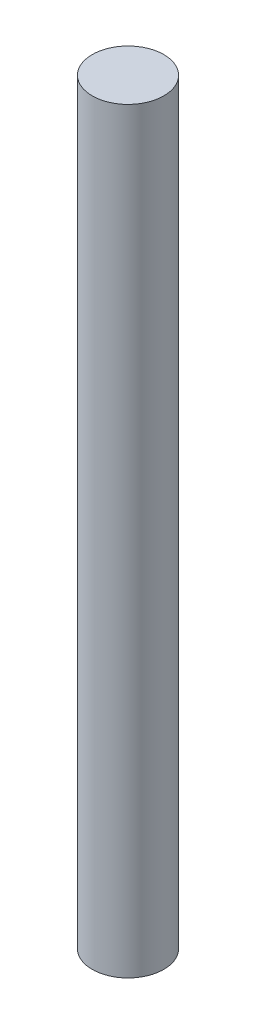
ISO-10303-21;
HEADER;
FILE_DESCRIPTION(('STEP AP214'),'2;1');
FILE_NAME('part.step','',(''),(''),'','','');
FILE_SCHEMA(('AUTOMOTIVE_DESIGN { 1 0 10303 214 1 1 1 1 }'));
ENDSEC;
DATA;
#1=APPLICATION_CONTEXT('core data for automotive mechanical design processes');
#2=APPLICATION_PROTOCOL_DEFINITION('international standard','automotive_design',2000,#1);
#3=PRODUCT_CONTEXT('',#1,'mechanical');
#4=PRODUCT('Part','Part','',(#3));
#5=PRODUCT_RELATED_PRODUCT_CATEGORY('part','',(#4));
#6=PRODUCT_DEFINITION_FORMATION('','',#4);
#7=PRODUCT_DEFINITION_CONTEXT('part definition',#1,'design');
#8=PRODUCT_DEFINITION('design','',#6,#7);
#9=PRODUCT_DEFINITION_SHAPE('','',#8);
#10=(LENGTH_UNIT() NAMED_UNIT(*) SI_UNIT(.MILLI.,.METRE.));
#11=(NAMED_UNIT(*) PLANE_ANGLE_UNIT() SI_UNIT($,.RADIAN.));
#12=(NAMED_UNIT(*) SI_UNIT($,.STERADIAN.) SOLID_ANGLE_UNIT());
#13=UNCERTAINTY_MEASURE_WITH_UNIT(LENGTH_MEASURE(1.E-05),#10,'distance_accuracy_value','');
#14=(GEOMETRIC_REPRESENTATION_CONTEXT(3) GLOBAL_UNCERTAINTY_ASSIGNED_CONTEXT((#13)) GLOBAL_UNIT_ASSIGNED_CONTEXT((#10,
#11,#12)) REPRESENTATION_CONTEXT('',''));
#15=CARTESIAN_POINT('',(0.,0.,0.));
#16=DIRECTION('',(0.,0.,1.));
#17=DIRECTION('',(1.,0.,0.));
#18=AXIS2_PLACEMENT_3D('',#15,#16,#17);
#19=CARTESIAN_POINT('',(0.,0.64,0.));
#20=DIRECTION('',(0.,1.,0.));
#21=DIRECTION('',(0.,0.,1.));
#22=AXIS2_PLACEMENT_3D('',#19,#20,#21);
#23=PLANE('',#22);
#24=CARTESIAN_POINT('',(2.54,0.64,2.87));
#25=DIRECTION('',(0.,-1.,0.));
#26=DIRECTION('',(0.,0.,-1.));
#27=AXIS2_PLACEMENT_3D('',#24,#25,#26);
#28=CIRCLE('',#27,0.255);
#29=CARTESIAN_POINT('',(2.54,0.64,2.615));
#30=VERTEX_POINT('',#29);
#31=EDGE_CURVE('E18',#30,#30,#28,.T.);
#32=ORIENTED_EDGE('',*,*,#31,.F.);
#33=EDGE_LOOP('',(#32));
#34=FACE_BOUND('',#33,.T.);
#35=ADVANCED_FACE('F15',(#34),#23,.T.);
#36=CARTESIAN_POINT('',(2.54,-4.75,2.87));
#37=DIRECTION('',(0.,-1.,0.));
#38=DIRECTION('',(0.,0.,-1.));
#39=AXIS2_PLACEMENT_3D('',#36,#37,#38);
#40=PLANE('',#39);
#41=CARTESIAN_POINT('',(2.54,-4.75,2.87));
#42=DIRECTION('',(0.,-1.,0.));
#43=DIRECTION('',(0.,0.,-1.));
#44=AXIS2_PLACEMENT_3D('',#41,#42,#43);
#45=CIRCLE('',#44,0.255);
#46=CARTESIAN_POINT('',(2.54,-4.75,2.615));
#47=VERTEX_POINT('',#46);
#48=EDGE_CURVE('E10',#47,#47,#45,.F.);
#49=ORIENTED_EDGE('',*,*,#48,.F.);
#50=EDGE_LOOP('',(#49));
#51=FACE_BOUND('',#50,.T.);
#52=ADVANCED_FACE('F30',(#51),#40,.T.);
#53=CARTESIAN_POINT('',(2.54,1.36124891681,2.87));
#54=DIRECTION('',(0.,-1.,0.));
#55=DIRECTION('',(0.,0.,-1.));
#56=AXIS2_PLACEMENT_3D('',#53,#54,#55);
#57=CYLINDRICAL_SURFACE('',#56,0.255);
#58=ORIENTED_EDGE('',*,*,#48,.T.);
#59=EDGE_LOOP('',(#58));
#60=FACE_BOUND('',#59,.T.);
#61=ORIENTED_EDGE('',*,*,#31,.T.);
#62=EDGE_LOOP('',(#61));
#63=FACE_BOUND('',#62,.T.);
#64=ADVANCED_FACE('F27',(#60,#63),#57,.T.);
#65=CLOSED_SHELL('',(#35,#52,#64));
#66=MANIFOLD_SOLID_BREP('B1',#65);
#67=ADVANCED_BREP_SHAPE_REPRESENTATION('',(#18,#66),#14);
#68=SHAPE_DEFINITION_REPRESENTATION(#9,#67);
ENDSEC;
END-ISO-10303-21;
